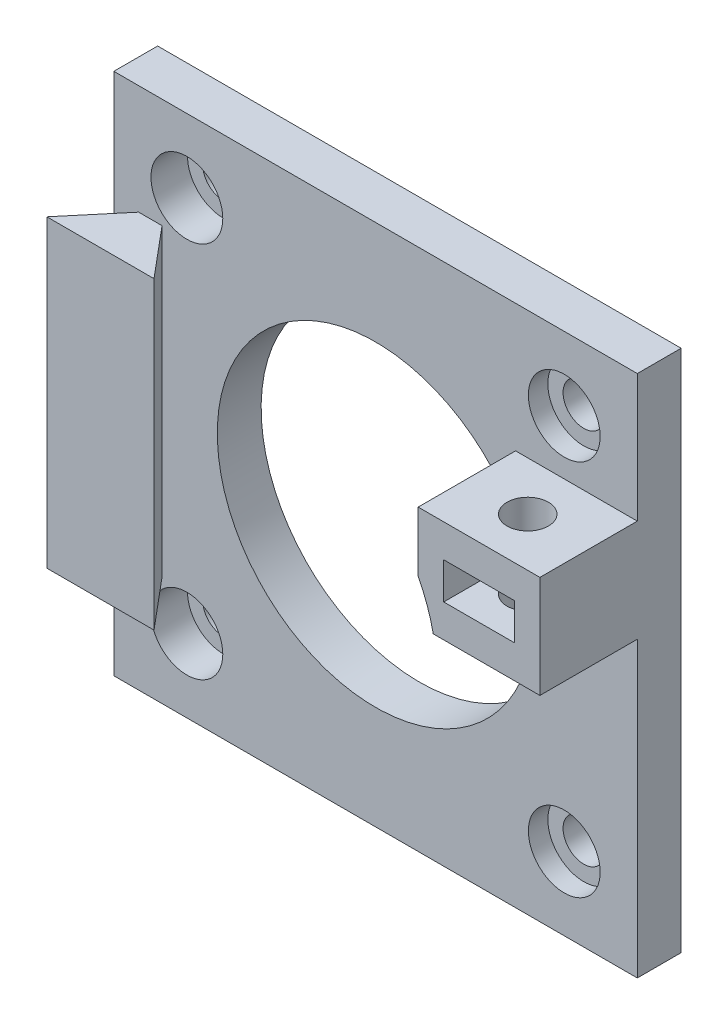
ISO-10303-21;
HEADER;
FILE_DESCRIPTION(('STEP AP214'),'2;1');
FILE_NAME('part.step','',(''),(''),'','','');
FILE_SCHEMA(('AUTOMOTIVE_DESIGN { 1 0 10303 214 1 1 1 1 }'));
ENDSEC;
DATA;
#1=APPLICATION_CONTEXT('core data for automotive mechanical design processes');
#2=APPLICATION_PROTOCOL_DEFINITION('international standard','automotive_design',2000,#1);
#3=PRODUCT_CONTEXT('',#1,'mechanical');
#4=PRODUCT('Part','Part','',(#3));
#5=PRODUCT_RELATED_PRODUCT_CATEGORY('part','',(#4));
#6=PRODUCT_DEFINITION_FORMATION('','',#4);
#7=PRODUCT_DEFINITION_CONTEXT('part definition',#1,'design');
#8=PRODUCT_DEFINITION('design','',#6,#7);
#9=PRODUCT_DEFINITION_SHAPE('','',#8);
#10=(LENGTH_UNIT() NAMED_UNIT(*) SI_UNIT(.MILLI.,.METRE.));
#11=(NAMED_UNIT(*) PLANE_ANGLE_UNIT() SI_UNIT($,.RADIAN.));
#12=(NAMED_UNIT(*) SI_UNIT($,.STERADIAN.) SOLID_ANGLE_UNIT());
#13=UNCERTAINTY_MEASURE_WITH_UNIT(LENGTH_MEASURE(1.E-05),#10,'distance_accuracy_value','');
#14=(GEOMETRIC_REPRESENTATION_CONTEXT(3) GLOBAL_UNCERTAINTY_ASSIGNED_CONTEXT((#13)) GLOBAL_UNIT_ASSIGNED_CONTEXT((#10,
#11,#12)) REPRESENTATION_CONTEXT('',''));
#15=CARTESIAN_POINT('',(0.,0.,0.));
#16=DIRECTION('',(0.,0.,1.));
#17=DIRECTION('',(1.,0.,0.));
#18=AXIS2_PLACEMENT_3D('',#15,#16,#17);
#19=CARTESIAN_POINT('',(-15.5,15.5,3.6));
#20=DIRECTION('',(0.,0.,-1.));
#21=DIRECTION('',(-1.,0.,0.));
#22=AXIS2_PLACEMENT_3D('',#19,#20,#21);
#23=CYLINDRICAL_SURFACE('',#22,1.7);
#24=CARTESIAN_POINT('',(-15.5,15.5,0.));
#25=DIRECTION('',(0.,0.,1.));
#26=DIRECTION('',(1.,0.,0.));
#27=AXIS2_PLACEMENT_3D('',#24,#25,#26);
#28=CIRCLE('',#27,1.7);
#29=CARTESIAN_POINT('',(-13.8,15.5,0.));
#30=VERTEX_POINT('',#29);
#31=EDGE_CURVE('E346',#30,#30,#28,.T.);
#32=ORIENTED_EDGE('',*,*,#31,.F.);
#33=EDGE_LOOP('',(#32));
#34=FACE_BOUND('',#33,.T.);
#35=CARTESIAN_POINT('',(-15.5,15.5,0.6));
#36=DIRECTION('',(0.,0.,1.));
#37=DIRECTION('',(1.,0.,0.));
#38=AXIS2_PLACEMENT_3D('',#35,#36,#37);
#39=CIRCLE('',#38,1.7);
#40=CARTESIAN_POINT('',(-13.8,15.5,0.6));
#41=VERTEX_POINT('',#40);
#42=EDGE_CURVE('E43',#41,#41,#39,.T.);
#43=ORIENTED_EDGE('',*,*,#42,.T.);
#44=EDGE_LOOP('',(#43));
#45=FACE_BOUND('',#44,.T.);
#46=ADVANCED_FACE('F39',(#34,#45),#23,.F.);
#47=CARTESIAN_POINT('',(-15.5,-15.5,3.6));
#48=DIRECTION('',(0.,0.,-1.));
#49=DIRECTION('',(-1.,0.,0.));
#50=AXIS2_PLACEMENT_3D('',#47,#48,#49);
#51=CYLINDRICAL_SURFACE('',#50,1.7);
#52=CARTESIAN_POINT('',(-15.5,-15.5,0.));
#53=DIRECTION('',(0.,0.,1.));
#54=DIRECTION('',(1.,0.,0.));
#55=AXIS2_PLACEMENT_3D('',#52,#53,#54);
#56=CIRCLE('',#55,1.7);
#57=CARTESIAN_POINT('',(-13.8,-15.5,0.));
#58=VERTEX_POINT('',#57);
#59=EDGE_CURVE('E342',#58,#58,#56,.T.);
#60=ORIENTED_EDGE('',*,*,#59,.F.);
#61=EDGE_LOOP('',(#60));
#62=FACE_BOUND('',#61,.T.);
#63=CARTESIAN_POINT('',(-15.5,-15.5,0.6));
#64=DIRECTION('',(0.,0.,1.));
#65=DIRECTION('',(1.,0.,0.));
#66=AXIS2_PLACEMENT_3D('',#63,#64,#65);
#67=CIRCLE('',#66,1.7);
#68=CARTESIAN_POINT('',(-13.8,-15.5,0.6));
#69=VERTEX_POINT('',#68);
#70=EDGE_CURVE('E195',#69,#69,#67,.T.);
#71=ORIENTED_EDGE('',*,*,#70,.T.);
#72=EDGE_LOOP('',(#71));
#73=FACE_BOUND('',#72,.T.);
#74=ADVANCED_FACE('F463',(#62,#73),#51,.F.);
#75=CARTESIAN_POINT('',(16.5,12.6,7.6));
#76=DIRECTION('',(0.,-1.,0.));
#77=DIRECTION('',(1.,0.,0.));
#78=AXIS2_PLACEMENT_3D('',#75,#76,#77);
#79=CYLINDRICAL_SURFACE('',#78,1.7);
#80=CARTESIAN_POINT('',(16.5,11.,7.6));
#81=DIRECTION('',(0.,-1.,0.));
#82=DIRECTION('',(1.,0.,0.));
#83=AXIS2_PLACEMENT_3D('',#80,#81,#82);
#84=CIRCLE('',#83,1.7);
#85=CARTESIAN_POINT('',(18.2,11.,7.6));
#86=VERTEX_POINT('',#85);
#87=EDGE_CURVE('E259',#86,#86,#84,.T.);
#88=ORIENTED_EDGE('',*,*,#87,.F.);
#89=EDGE_LOOP('',(#88));
#90=FACE_BOUND('',#89,.T.);
#91=CARTESIAN_POINT('',(16.5,8.29999999999988,7.6));
#92=DIRECTION('',(0.,-1.,0.));
#93=DIRECTION('',(1.,0.,0.));
#94=AXIS2_PLACEMENT_3D('',#91,#92,#93);
#95=CIRCLE('',#94,1.7);
#96=CARTESIAN_POINT('',(18.2,8.29999999999987,7.6));
#97=VERTEX_POINT('',#96);
#98=EDGE_CURVE('E246',#97,#97,#95,.F.);
#99=ORIENTED_EDGE('',*,*,#98,.F.);
#100=EDGE_LOOP('',(#99));
#101=FACE_BOUND('',#100,.T.);
#102=ADVANCED_FACE('F469',(#90,#101),#79,.F.);
#103=CARTESIAN_POINT('',(15.5,-15.5,3.6));
#104=DIRECTION('',(0.,0.,-1.));
#105=DIRECTION('',(-1.,0.,0.));
#106=AXIS2_PLACEMENT_3D('',#103,#104,#105);
#107=CYLINDRICAL_SURFACE('',#106,1.7);
#108=CARTESIAN_POINT('',(15.5,-15.5,0.));
#109=DIRECTION('',(0.,0.,1.));
#110=DIRECTION('',(1.,0.,0.));
#111=AXIS2_PLACEMENT_3D('',#108,#109,#110);
#112=CIRCLE('',#111,1.7);
#113=CARTESIAN_POINT('',(17.2,-15.5,0.));
#114=VERTEX_POINT('',#113);
#115=EDGE_CURVE('E337',#114,#114,#112,.T.);
#116=ORIENTED_EDGE('',*,*,#115,.F.);
#117=EDGE_LOOP('',(#116));
#118=FACE_BOUND('',#117,.T.);
#119=CARTESIAN_POINT('',(15.5,-15.5,2.));
#120=DIRECTION('',(0.,0.,1.));
#121=DIRECTION('',(1.,0.,0.));
#122=AXIS2_PLACEMENT_3D('',#119,#120,#121);
#123=CIRCLE('',#122,1.7);
#124=CARTESIAN_POINT('',(17.2,-15.5,2.));
#125=VERTEX_POINT('',#124);
#126=EDGE_CURVE('E338',#125,#125,#123,.T.);
#127=ORIENTED_EDGE('',*,*,#126,.T.);
#128=EDGE_LOOP('',(#127));
#129=FACE_BOUND('',#128,.T.);
#130=ADVANCED_FACE('F545',(#118,#129),#107,.F.);
#131=CARTESIAN_POINT('',(15.5,15.5,3.6));
#132=DIRECTION('',(0.,0.,-1.));
#133=DIRECTION('',(-1.,0.,0.));
#134=AXIS2_PLACEMENT_3D('',#131,#132,#133);
#135=CYLINDRICAL_SURFACE('',#134,1.7);
#136=CARTESIAN_POINT('',(15.5,15.5,0.));
#137=DIRECTION('',(0.,0.,1.));
#138=DIRECTION('',(1.,0.,0.));
#139=AXIS2_PLACEMENT_3D('',#136,#137,#138);
#140=CIRCLE('',#139,1.7);
#141=CARTESIAN_POINT('',(17.2,15.5,0.));
#142=VERTEX_POINT('',#141);
#143=EDGE_CURVE('E333',#142,#142,#140,.T.);
#144=ORIENTED_EDGE('',*,*,#143,.F.);
#145=EDGE_LOOP('',(#144));
#146=FACE_BOUND('',#145,.T.);
#147=CARTESIAN_POINT('',(15.5,15.5,2.));
#148=DIRECTION('',(0.,0.,1.));
#149=DIRECTION('',(1.,0.,0.));
#150=AXIS2_PLACEMENT_3D('',#147,#148,#149);
#151=CIRCLE('',#150,1.7);
#152=CARTESIAN_POINT('',(17.2,15.5,2.));
#153=VERTEX_POINT('',#152);
#154=EDGE_CURVE('E332',#153,#153,#151,.T.);
#155=ORIENTED_EDGE('',*,*,#154,.T.);
#156=EDGE_LOOP('',(#155));
#157=FACE_BOUND('',#156,.T.);
#158=ADVANCED_FACE('F486',(#146,#157),#135,.F.);
#159=CARTESIAN_POINT('',(0.,0.,3.6));
#160=DIRECTION('',(0.,0.,1.));
#161=DIRECTION('',(1.,0.,0.));
#162=AXIS2_PLACEMENT_3D('',#159,#160,#161);
#163=PLANE('',#162);
#164=DIRECTION('',(1.,0.,0.));
#165=VECTOR('',#164,1.);
#166=CARTESIAN_POINT('',(0.,-12.5,3.6));
#167=LINE('',#166,#165);
#168=CARTESIAN_POINT('',(-19.4596915121731,-12.5,3.6));
#169=VERTEX_POINT('',#168);
#170=CARTESIAN_POINT('',(-17.5403084878269,-12.5,3.6));
#171=VERTEX_POINT('',#170);
#172=EDGE_CURVE('E11',#169,#171,#167,.T.);
#173=ORIENTED_EDGE('',*,*,#172,.F.);
#174=DIRECTION('',(0.,-1.,0.));
#175=VECTOR('',#174,1.);
#176=CARTESIAN_POINT('',(-19.4596915121731,0.,3.6));
#177=LINE('',#176,#175);
#178=CARTESIAN_POINT('',(-19.4596915121731,12.5,3.6));
#179=VERTEX_POINT('',#178);
#180=EDGE_CURVE('E49',#179,#169,#177,.T.);
#181=ORIENTED_EDGE('',*,*,#180,.F.);
#182=DIRECTION('',(1.,0.,0.));
#183=VECTOR('',#182,1.);
#184=CARTESIAN_POINT('',(0.,12.5,3.6));
#185=LINE('',#184,#183);
#186=CARTESIAN_POINT('',(-17.5403084878269,12.5,3.6));
#187=VERTEX_POINT('',#186);
#188=EDGE_CURVE('E424',#179,#187,#185,.T.);
#189=ORIENTED_EDGE('',*,*,#188,.T.);
#190=DIRECTION('',(0.,1.,0.));
#191=VECTOR('',#190,1.);
#192=CARTESIAN_POINT('',(-17.5403084878269,0.,3.6));
#193=LINE('',#192,#191);
#194=EDGE_CURVE('E183',#171,#187,#193,.T.);
#195=ORIENTED_EDGE('',*,*,#194,.F.);
#196=EDGE_LOOP('',(#173,#181,#189,#195));
#197=FACE_BOUND('',#196,.T.);
#198=DIRECTION('',(0.,-1.,0.));
#199=VECTOR('',#198,1.);
#200=CARTESIAN_POINT('',(11.5,6.06217782649108,3.6));
#201=LINE('',#200,#199);
#202=CARTESIAN_POINT('',(11.5,11.,3.6));
#203=VERTEX_POINT('',#202);
#204=CARTESIAN_POINT('',(11.5,6.06217782649109,3.6));
#205=VERTEX_POINT('',#204);
#206=EDGE_CURVE('E278',#203,#205,#201,.T.);
#207=ORIENTED_EDGE('',*,*,#206,.F.);
#208=DIRECTION('',(-1.,0.,0.));
#209=VECTOR('',#208,1.);
#210=CARTESIAN_POINT('',(21.5,11.,3.6));
#211=LINE('',#210,#209);
#212=CARTESIAN_POINT('',(21.5,11.,3.6));
#213=VERTEX_POINT('',#212);
#214=EDGE_CURVE('E265',#213,#203,#211,.T.);
#215=ORIENTED_EDGE('',*,*,#214,.F.);
#216=DIRECTION('',(0.,1.,0.));
#217=VECTOR('',#216,1.);
#218=CARTESIAN_POINT('',(21.5,-21.5,3.6));
#219=LINE('',#218,#217);
#220=CARTESIAN_POINT('',(21.5,21.5,3.6));
#221=VERTEX_POINT('',#220);
#222=EDGE_CURVE('E367',#213,#221,#219,.T.);
#223=ORIENTED_EDGE('',*,*,#222,.T.);
#224=DIRECTION('',(-1.,0.,0.));
#225=VECTOR('',#224,1.);
#226=CARTESIAN_POINT('',(21.5,21.5,3.6));
#227=LINE('',#226,#225);
#228=CARTESIAN_POINT('',(-21.5,21.5,3.6));
#229=VERTEX_POINT('',#228);
#230=EDGE_CURVE('E371',#221,#229,#227,.T.);
#231=ORIENTED_EDGE('',*,*,#230,.T.);
#232=DIRECTION('',(0.,-1.,0.));
#233=VECTOR('',#232,1.);
#234=CARTESIAN_POINT('',(-21.5,-21.5,3.6));
#235=LINE('',#234,#233);
#236=CARTESIAN_POINT('',(-21.5,-21.5,3.6));
#237=VERTEX_POINT('',#236);
#238=EDGE_CURVE('E359',#229,#237,#235,.T.);
#239=ORIENTED_EDGE('',*,*,#238,.T.);
#240=DIRECTION('',(1.,0.,0.));
#241=VECTOR('',#240,1.);
#242=CARTESIAN_POINT('',(21.5,-21.5,3.6));
#243=LINE('',#242,#241);
#244=CARTESIAN_POINT('',(21.5,-21.5,3.6));
#245=VERTEX_POINT('',#244);
#246=EDGE_CURVE('E363',#237,#245,#243,.T.);
#247=ORIENTED_EDGE('',*,*,#246,.T.);
#248=CARTESIAN_POINT('',(21.5,2.6,3.6));
#249=VERTEX_POINT('',#248);
#250=EDGE_CURVE('E368',#245,#249,#219,.T.);
#251=ORIENTED_EDGE('',*,*,#250,.T.);
#252=DIRECTION('',(1.,0.,0.));
#253=VECTOR('',#252,1.);
#254=CARTESIAN_POINT('',(21.5,2.6,3.6));
#255=LINE('',#254,#253);
#256=CARTESIAN_POINT('',(12.7373466624725,2.6,3.6));
#257=VERTEX_POINT('',#256);
#258=EDGE_CURVE('E282',#257,#249,#255,.T.);
#259=ORIENTED_EDGE('',*,*,#258,.F.);
#260=CARTESIAN_POINT('',(0.,0.,3.6));
#261=DIRECTION('',(0.,0.,1.));
#262=DIRECTION('',(1.,0.,0.));
#263=AXIS2_PLACEMENT_3D('',#260,#261,#262);
#264=CIRCLE('',#263,13.);
#265=EDGE_CURVE('E351',#205,#257,#264,.T.);
#266=ORIENTED_EDGE('',*,*,#265,.F.);
#267=EDGE_LOOP('',(#207,#215,#223,#231,#239,#247,#251,#259,#266));
#268=FACE_BOUND('',#267,.T.);
#269=CARTESIAN_POINT('',(15.5,15.5,3.6));
#270=DIRECTION('',(0.,0.,1.));
#271=DIRECTION('',(1.,0.,0.));
#272=AXIS2_PLACEMENT_3D('',#269,#270,#271);
#273=CIRCLE('',#272,2.95);
#274=CARTESIAN_POINT('',(18.45,15.5,3.6));
#275=VERTEX_POINT('',#274);
#276=EDGE_CURVE('E322',#275,#275,#273,.T.);
#277=ORIENTED_EDGE('',*,*,#276,.F.);
#278=EDGE_LOOP('',(#277));
#279=FACE_BOUND('',#278,.T.);
#280=CARTESIAN_POINT('',(-15.5,-15.5,3.6));
#281=DIRECTION('',(0.,0.,1.));
#282=DIRECTION('',(1.,0.,0.));
#283=AXIS2_PLACEMENT_3D('',#280,#281,#282);
#284=CIRCLE('',#283,2.95);
#285=CARTESIAN_POINT('',(-12.55,-15.5,3.6));
#286=VERTEX_POINT('',#285);
#287=EDGE_CURVE('E313',#286,#286,#284,.T.);
#288=ORIENTED_EDGE('',*,*,#287,.F.);
#289=EDGE_LOOP('',(#288));
#290=FACE_BOUND('',#289,.T.);
#291=CARTESIAN_POINT('',(15.5,-15.5,3.6));
#292=DIRECTION('',(0.,0.,1.));
#293=DIRECTION('',(1.,0.,0.));
#294=AXIS2_PLACEMENT_3D('',#291,#292,#293);
#295=CIRCLE('',#294,2.95);
#296=CARTESIAN_POINT('',(18.45,-15.5,3.6));
#297=VERTEX_POINT('',#296);
#298=EDGE_CURVE('E308',#297,#297,#295,.T.);
#299=ORIENTED_EDGE('',*,*,#298,.F.);
#300=EDGE_LOOP('',(#299));
#301=FACE_BOUND('',#300,.T.);
#302=CARTESIAN_POINT('',(-15.5,15.5,3.6));
#303=DIRECTION('',(0.,0.,1.));
#304=DIRECTION('',(1.,0.,0.));
#305=AXIS2_PLACEMENT_3D('',#302,#303,#304);
#306=CIRCLE('',#305,2.95);
#307=CARTESIAN_POINT('',(-12.55,15.5,3.6));
#308=VERTEX_POINT('',#307);
#309=EDGE_CURVE('E321',#308,#308,#306,.T.);
#310=ORIENTED_EDGE('',*,*,#309,.F.);
#311=EDGE_LOOP('',(#310));
#312=FACE_BOUND('',#311,.T.);
#313=ADVANCED_FACE('F482',(#197,#268,#279,#290,#301,#312),#163,.T.);
#314=CARTESIAN_POINT('',(0.,0.,0.));
#315=DIRECTION('',(0.,0.,1.));
#316=DIRECTION('',(1.,0.,0.));
#317=AXIS2_PLACEMENT_3D('',#314,#315,#316);
#318=PLANE('',#317);
#319=DIRECTION('',(0.,-1.,0.));
#320=VECTOR('',#319,1.);
#321=CARTESIAN_POINT('',(-21.5,-21.5,0.));
#322=LINE('',#321,#320);
#323=CARTESIAN_POINT('',(-21.5,21.5,0.));
#324=VERTEX_POINT('',#323);
#325=CARTESIAN_POINT('',(-21.5,-21.5,0.));
#326=VERTEX_POINT('',#325);
#327=EDGE_CURVE('E355',#324,#326,#322,.T.);
#328=ORIENTED_EDGE('',*,*,#327,.F.);
#329=DIRECTION('',(-1.,0.,0.));
#330=VECTOR('',#329,1.);
#331=CARTESIAN_POINT('',(21.5,21.5,0.));
#332=LINE('',#331,#330);
#333=CARTESIAN_POINT('',(21.5,21.5,0.));
#334=VERTEX_POINT('',#333);
#335=EDGE_CURVE('E364',#334,#324,#332,.T.);
#336=ORIENTED_EDGE('',*,*,#335,.F.);
#337=DIRECTION('',(0.,1.,0.));
#338=VECTOR('',#337,1.);
#339=CARTESIAN_POINT('',(21.5,-21.5,0.));
#340=LINE('',#339,#338);
#341=CARTESIAN_POINT('',(21.5,-21.5,0.));
#342=VERTEX_POINT('',#341);
#343=EDGE_CURVE('E381',#342,#334,#340,.T.);
#344=ORIENTED_EDGE('',*,*,#343,.F.);
#345=DIRECTION('',(1.,0.,0.));
#346=VECTOR('',#345,1.);
#347=CARTESIAN_POINT('',(21.5,-21.5,0.));
#348=LINE('',#347,#346);
#349=EDGE_CURVE('E378',#326,#342,#348,.T.);
#350=ORIENTED_EDGE('',*,*,#349,.F.);
#351=EDGE_LOOP('',(#328,#336,#344,#350));
#352=FACE_BOUND('',#351,.T.);
#353=CARTESIAN_POINT('',(0.,0.,0.));
#354=DIRECTION('',(0.,0.,1.));
#355=DIRECTION('',(1.,0.,0.));
#356=AXIS2_PLACEMENT_3D('',#353,#354,#355);
#357=CIRCLE('',#356,13.);
#358=CARTESIAN_POINT('',(13.,0.,0.));
#359=VERTEX_POINT('',#358);
#360=EDGE_CURVE('E350',#359,#359,#357,.T.);
#361=ORIENTED_EDGE('',*,*,#360,.T.);
#362=EDGE_LOOP('',(#361));
#363=FACE_BOUND('',#362,.T.);
#364=ORIENTED_EDGE('',*,*,#31,.T.);
#365=EDGE_LOOP('',(#364));
#366=FACE_BOUND('',#365,.T.);
#367=ORIENTED_EDGE('',*,*,#59,.T.);
#368=EDGE_LOOP('',(#367));
#369=FACE_BOUND('',#368,.T.);
#370=ORIENTED_EDGE('',*,*,#115,.T.);
#371=EDGE_LOOP('',(#370));
#372=FACE_BOUND('',#371,.T.);
#373=ORIENTED_EDGE('',*,*,#143,.T.);
#374=EDGE_LOOP('',(#373));
#375=FACE_BOUND('',#374,.T.);
#376=ADVANCED_FACE('F485',(#352,#363,#366,#369,#372,#375),#318,.F.);
#377=CARTESIAN_POINT('',(-21.5,-21.5,3.6));
#378=DIRECTION('',(1.,0.,0.));
#379=DIRECTION('',(0.,0.,-1.));
#380=AXIS2_PLACEMENT_3D('',#377,#378,#379);
#381=PLANE('',#380);
#382=ORIENTED_EDGE('',*,*,#327,.T.);
#383=DIRECTION('',(0.,0.,-1.));
#384=VECTOR('',#383,1.);
#385=CARTESIAN_POINT('',(-21.5,-21.5,3.6));
#386=LINE('',#385,#384);
#387=EDGE_CURVE('E397',#237,#326,#386,.T.);
#388=ORIENTED_EDGE('',*,*,#387,.F.);
#389=ORIENTED_EDGE('',*,*,#238,.F.);
#390=DIRECTION('',(0.,0.,-1.));
#391=VECTOR('',#390,1.);
#392=CARTESIAN_POINT('',(-21.5,21.5,3.6));
#393=LINE('',#392,#391);
#394=EDGE_CURVE('E374',#229,#324,#393,.T.);
#395=ORIENTED_EDGE('',*,*,#394,.T.);
#396=EDGE_LOOP('',(#382,#388,#389,#395));
#397=FACE_BOUND('',#396,.T.);
#398=ADVANCED_FACE('F41',(#397),#381,.F.);
#399=CARTESIAN_POINT('',(21.5,-21.5,3.6));
#400=DIRECTION('',(0.,1.,0.));
#401=DIRECTION('',(-1.,0.,0.));
#402=AXIS2_PLACEMENT_3D('',#399,#400,#401);
#403=PLANE('',#402);
#404=ORIENTED_EDGE('',*,*,#349,.T.);
#405=DIRECTION('',(0.,0.,-1.));
#406=VECTOR('',#405,1.);
#407=CARTESIAN_POINT('',(21.5,-21.5,3.6));
#408=LINE('',#407,#406);
#409=EDGE_CURVE('E393',#245,#342,#408,.T.);
#410=ORIENTED_EDGE('',*,*,#409,.F.);
#411=ORIENTED_EDGE('',*,*,#246,.F.);
#412=ORIENTED_EDGE('',*,*,#387,.T.);
#413=EDGE_LOOP('',(#404,#410,#411,#412));
#414=FACE_BOUND('',#413,.T.);
#415=ADVANCED_FACE('F496',(#414),#403,.F.);
#416=CARTESIAN_POINT('',(21.5,-21.5,3.6));
#417=DIRECTION('',(-1.,0.,0.));
#418=DIRECTION('',(0.,0.,1.));
#419=AXIS2_PLACEMENT_3D('',#416,#417,#418);
#420=PLANE('',#419);
#421=ORIENTED_EDGE('',*,*,#343,.T.);
#422=DIRECTION('',(0.,0.,-1.));
#423=VECTOR('',#422,1.);
#424=CARTESIAN_POINT('',(21.5,21.5,3.6));
#425=LINE('',#424,#423);
#426=EDGE_CURVE('E389',#221,#334,#425,.T.);
#427=ORIENTED_EDGE('',*,*,#426,.F.);
#428=ORIENTED_EDGE('',*,*,#222,.F.);
#429=DIRECTION('',(0.,0.,-1.));
#430=VECTOR('',#429,1.);
#431=CARTESIAN_POINT('',(21.5,11.,11.6));
#432=LINE('',#431,#430);
#433=CARTESIAN_POINT('',(21.5,11.,11.6));
#434=VERTEX_POINT('',#433);
#435=EDGE_CURVE('E292',#434,#213,#432,.T.);
#436=ORIENTED_EDGE('',*,*,#435,.F.);
#437=DIRECTION('',(0.,1.,0.));
#438=VECTOR('',#437,1.);
#439=CARTESIAN_POINT('',(21.5,2.6,11.6));
#440=LINE('',#439,#438);
#441=CARTESIAN_POINT('',(21.5,2.6,11.6));
#442=VERTEX_POINT('',#441);
#443=EDGE_CURVE('E271',#442,#434,#440,.T.);
#444=ORIENTED_EDGE('',*,*,#443,.F.);
#445=DIRECTION('',(0.,0.,-1.));
#446=VECTOR('',#445,1.);
#447=CARTESIAN_POINT('',(21.5,2.6,11.6));
#448=LINE('',#447,#446);
#449=EDGE_CURVE('E296',#442,#249,#448,.T.);
#450=ORIENTED_EDGE('',*,*,#449,.T.);
#451=ORIENTED_EDGE('',*,*,#250,.F.);
#452=ORIENTED_EDGE('',*,*,#409,.T.);
#453=EDGE_LOOP('',(#421,#427,#428,#436,#444,#450,#451,#452));
#454=FACE_BOUND('',#453,.T.);
#455=ADVANCED_FACE('F493',(#454),#420,.F.);
#456=CARTESIAN_POINT('',(21.5,21.5,3.6));
#457=DIRECTION('',(0.,-1.,0.));
#458=DIRECTION('',(1.,0.,0.));
#459=AXIS2_PLACEMENT_3D('',#456,#457,#458);
#460=PLANE('',#459);
#461=ORIENTED_EDGE('',*,*,#335,.T.);
#462=ORIENTED_EDGE('',*,*,#394,.F.);
#463=ORIENTED_EDGE('',*,*,#230,.F.);
#464=ORIENTED_EDGE('',*,*,#426,.T.);
#465=EDGE_LOOP('',(#461,#462,#463,#464));
#466=FACE_BOUND('',#465,.T.);
#467=ADVANCED_FACE('F480',(#466),#460,.F.);
#468=CARTESIAN_POINT('',(0.,0.,3.6));
#469=DIRECTION('',(0.,0.,-1.));
#470=DIRECTION('',(-1.,0.,0.));
#471=AXIS2_PLACEMENT_3D('',#468,#469,#470);
#472=CYLINDRICAL_SURFACE('',#471,13.);
#473=ORIENTED_EDGE('',*,*,#265,.T.);
#474=DIRECTION('',(0.,0.,-1.));
#475=VECTOR('',#474,1.);
#476=CARTESIAN_POINT('',(12.7373466624725,2.6,11.6));
#477=LINE('',#476,#475);
#478=CARTESIAN_POINT('',(12.7373466624725,2.6,11.6));
#479=VERTEX_POINT('',#478);
#480=EDGE_CURVE('E300',#479,#257,#477,.T.);
#481=ORIENTED_EDGE('',*,*,#480,.F.);
#482=CARTESIAN_POINT('',(0.,0.,11.6));
#483=DIRECTION('',(0.,0.,-1.));
#484=DIRECTION('',(1.,0.,0.));
#485=AXIS2_PLACEMENT_3D('',#482,#483,#484);
#486=CIRCLE('',#485,13.);
#487=CARTESIAN_POINT('',(11.5,6.06217782649108,11.6));
#488=VERTEX_POINT('',#487);
#489=EDGE_CURVE('E264',#488,#479,#486,.T.);
#490=ORIENTED_EDGE('',*,*,#489,.F.);
#491=DIRECTION('',(0.,0.,-1.));
#492=VECTOR('',#491,1.);
#493=CARTESIAN_POINT('',(11.5,6.06217782649108,11.6));
#494=LINE('',#493,#492);
#495=EDGE_CURVE('E304',#488,#205,#494,.T.);
#496=ORIENTED_EDGE('',*,*,#495,.T.);
#497=EDGE_LOOP('',(#473,#481,#490,#496));
#498=FACE_BOUND('',#497,.T.);
#499=ORIENTED_EDGE('',*,*,#360,.F.);
#500=EDGE_LOOP('',(#499));
#501=FACE_BOUND('',#500,.T.);
#502=ADVANCED_FACE('F476',(#498,#501),#472,.F.);
#503=CARTESIAN_POINT('',(15.5,15.5,2.));
#504=DIRECTION('',(0.,0.,1.));
#505=DIRECTION('',(1.,0.,0.));
#506=AXIS2_PLACEMENT_3D('',#503,#504,#505);
#507=CYLINDRICAL_SURFACE('',#506,2.95);
#508=CARTESIAN_POINT('',(15.5,15.5,2.));
#509=DIRECTION('',(0.,0.,1.));
#510=DIRECTION('',(1.,0.,0.));
#511=AXIS2_PLACEMENT_3D('',#508,#509,#510);
#512=CIRCLE('',#511,2.95);
#513=CARTESIAN_POINT('',(18.45,15.5,2.));
#514=VERTEX_POINT('',#513);
#515=EDGE_CURVE('E317',#514,#514,#512,.T.);
#516=ORIENTED_EDGE('',*,*,#515,.F.);
#517=EDGE_LOOP('',(#516));
#518=FACE_BOUND('',#517,.T.);
#519=ORIENTED_EDGE('',*,*,#276,.T.);
#520=EDGE_LOOP('',(#519));
#521=FACE_BOUND('',#520,.T.);
#522=ADVANCED_FACE('F479',(#518,#521),#507,.F.);
#523=CARTESIAN_POINT('',(15.5,15.5,2.));
#524=DIRECTION('',(0.,0.,1.));
#525=DIRECTION('',(1.,0.,0.));
#526=AXIS2_PLACEMENT_3D('',#523,#524,#525);
#527=PLANE('',#526);
#528=ORIENTED_EDGE('',*,*,#154,.F.);
#529=EDGE_LOOP('',(#528));
#530=FACE_BOUND('',#529,.T.);
#531=ORIENTED_EDGE('',*,*,#515,.T.);
#532=EDGE_LOOP('',(#531));
#533=FACE_BOUND('',#532,.T.);
#534=ADVANCED_FACE('F548',(#530,#533),#527,.T.);
#535=CARTESIAN_POINT('',(15.5,-15.5,2.));
#536=DIRECTION('',(0.,0.,1.));
#537=DIRECTION('',(1.,0.,0.));
#538=AXIS2_PLACEMENT_3D('',#535,#536,#537);
#539=CYLINDRICAL_SURFACE('',#538,2.95);
#540=CARTESIAN_POINT('',(15.5,-15.5,2.));
#541=DIRECTION('',(0.,0.,1.));
#542=DIRECTION('',(1.,0.,0.));
#543=AXIS2_PLACEMENT_3D('',#540,#541,#542);
#544=CIRCLE('',#543,2.95);
#545=CARTESIAN_POINT('',(18.45,-15.5,2.));
#546=VERTEX_POINT('',#545);
#547=EDGE_CURVE('E309',#546,#546,#544,.T.);
#548=ORIENTED_EDGE('',*,*,#547,.F.);
#549=EDGE_LOOP('',(#548));
#550=FACE_BOUND('',#549,.T.);
#551=ORIENTED_EDGE('',*,*,#298,.T.);
#552=EDGE_LOOP('',(#551));
#553=FACE_BOUND('',#552,.T.);
#554=ADVANCED_FACE('F551',(#550,#553),#539,.F.);
#555=CARTESIAN_POINT('',(15.5,-15.5,2.));
#556=DIRECTION('',(0.,0.,1.));
#557=DIRECTION('',(1.,0.,0.));
#558=AXIS2_PLACEMENT_3D('',#555,#556,#557);
#559=PLANE('',#558);
#560=ORIENTED_EDGE('',*,*,#126,.F.);
#561=EDGE_LOOP('',(#560));
#562=FACE_BOUND('',#561,.T.);
#563=ORIENTED_EDGE('',*,*,#547,.T.);
#564=EDGE_LOOP('',(#563));
#565=FACE_BOUND('',#564,.T.);
#566=ADVANCED_FACE('F458',(#562,#565),#559,.T.);
#567=CARTESIAN_POINT('',(-15.5,-15.5,2.));
#568=DIRECTION('',(0.,0.,1.));
#569=DIRECTION('',(1.,0.,0.));
#570=AXIS2_PLACEMENT_3D('',#567,#568,#569);
#571=CYLINDRICAL_SURFACE('',#570,2.95);
#572=ORIENTED_EDGE('',*,*,#287,.T.);
#573=EDGE_LOOP('',(#572));
#574=FACE_BOUND('',#573,.T.);
#575=CARTESIAN_POINT('',(-15.5,-15.5,0.6));
#576=DIRECTION('',(0.,0.,1.));
#577=DIRECTION('',(1.,0.,0.));
#578=AXIS2_PLACEMENT_3D('',#575,#576,#577);
#579=CIRCLE('',#578,2.95);
#580=CARTESIAN_POINT('',(-12.55,-15.5,0.6));
#581=VERTEX_POINT('',#580);
#582=EDGE_CURVE('E432',#581,#581,#579,.T.);
#583=ORIENTED_EDGE('',*,*,#582,.F.);
#584=EDGE_LOOP('',(#583));
#585=FACE_BOUND('',#584,.T.);
#586=ADVANCED_FACE('F448',(#574,#585),#571,.F.);
#587=CARTESIAN_POINT('',(-15.5,15.5,2.));
#588=DIRECTION('',(0.,0.,1.));
#589=DIRECTION('',(1.,0.,0.));
#590=AXIS2_PLACEMENT_3D('',#587,#588,#589);
#591=CYLINDRICAL_SURFACE('',#590,2.95);
#592=ORIENTED_EDGE('',*,*,#309,.T.);
#593=EDGE_LOOP('',(#592));
#594=FACE_BOUND('',#593,.T.);
#595=CARTESIAN_POINT('',(-15.5,15.5,0.6));
#596=DIRECTION('',(0.,0.,1.));
#597=DIRECTION('',(1.,0.,0.));
#598=AXIS2_PLACEMENT_3D('',#595,#596,#597);
#599=CIRCLE('',#598,2.95);
#600=CARTESIAN_POINT('',(-12.55,15.5,0.6));
#601=VERTEX_POINT('',#600);
#602=EDGE_CURVE('E197',#601,#601,#599,.T.);
#603=ORIENTED_EDGE('',*,*,#602,.F.);
#604=EDGE_LOOP('',(#603));
#605=FACE_BOUND('',#604,.T.);
#606=ADVANCED_FACE('F445',(#594,#605),#591,.F.);
#607=CARTESIAN_POINT('',(11.5,6.06217782649108,11.6));
#608=DIRECTION('',(1.,0.,0.));
#609=DIRECTION('',(0.,0.,-1.));
#610=AXIS2_PLACEMENT_3D('',#607,#608,#609);
#611=PLANE('',#610);
#612=ORIENTED_EDGE('',*,*,#206,.T.);
#613=ORIENTED_EDGE('',*,*,#495,.F.);
#614=DIRECTION('',(0.,-1.,0.));
#615=VECTOR('',#614,1.);
#616=CARTESIAN_POINT('',(11.5,6.06217782649108,11.6));
#617=LINE('',#616,#615);
#618=CARTESIAN_POINT('',(11.5,11.,11.6));
#619=VERTEX_POINT('',#618);
#620=EDGE_CURVE('E260',#619,#488,#617,.T.);
#621=ORIENTED_EDGE('',*,*,#620,.F.);
#622=DIRECTION('',(0.,0.,-1.));
#623=VECTOR('',#622,1.);
#624=CARTESIAN_POINT('',(11.5,11.,11.6));
#625=LINE('',#624,#623);
#626=EDGE_CURVE('E277',#619,#203,#625,.T.);
#627=ORIENTED_EDGE('',*,*,#626,.T.);
#628=EDGE_LOOP('',(#612,#613,#621,#627));
#629=FACE_BOUND('',#628,.T.);
#630=ADVANCED_FACE('F447',(#629),#611,.F.);
#631=CARTESIAN_POINT('',(21.5,2.6,11.6));
#632=DIRECTION('',(0.,1.,0.));
#633=DIRECTION('',(-1.,0.,0.));
#634=AXIS2_PLACEMENT_3D('',#631,#632,#633);
#635=PLANE('',#634);
#636=CARTESIAN_POINT('',(16.5,2.6,7.6));
#637=DIRECTION('',(0.,-1.,0.));
#638=DIRECTION('',(1.,0.,0.));
#639=AXIS2_PLACEMENT_3D('',#636,#637,#638);
#640=CIRCLE('',#639,1.7);
#641=CARTESIAN_POINT('',(18.2,2.6,7.6));
#642=VERTEX_POINT('',#641);
#643=EDGE_CURVE('E255',#642,#642,#640,.T.);
#644=ORIENTED_EDGE('',*,*,#643,.F.);
#645=EDGE_LOOP('',(#644));
#646=FACE_BOUND('',#645,.T.);
#647=ORIENTED_EDGE('',*,*,#258,.T.);
#648=ORIENTED_EDGE('',*,*,#449,.F.);
#649=DIRECTION('',(1.,0.,0.));
#650=VECTOR('',#649,1.);
#651=CARTESIAN_POINT('',(21.5,2.6,11.6));
#652=LINE('',#651,#650);
#653=EDGE_CURVE('E268',#479,#442,#652,.T.);
#654=ORIENTED_EDGE('',*,*,#653,.F.);
#655=ORIENTED_EDGE('',*,*,#480,.T.);
#656=EDGE_LOOP('',(#647,#648,#654,#655));
#657=FACE_BOUND('',#656,.T.);
#658=ADVANCED_FACE('F455',(#646,#657),#635,.F.);
#659=CARTESIAN_POINT('',(21.5,11.,11.6));
#660=DIRECTION('',(0.,-1.,0.));
#661=DIRECTION('',(1.,0.,0.));
#662=AXIS2_PLACEMENT_3D('',#659,#660,#661);
#663=PLANE('',#662);
#664=ORIENTED_EDGE('',*,*,#87,.T.);
#665=EDGE_LOOP('',(#664));
#666=FACE_BOUND('',#665,.T.);
#667=ORIENTED_EDGE('',*,*,#214,.T.);
#668=ORIENTED_EDGE('',*,*,#626,.F.);
#669=DIRECTION('',(-1.,0.,0.));
#670=VECTOR('',#669,1.);
#671=CARTESIAN_POINT('',(21.5,11.,11.6));
#672=LINE('',#671,#670);
#673=EDGE_CURVE('E274',#434,#619,#672,.T.);
#674=ORIENTED_EDGE('',*,*,#673,.F.);
#675=ORIENTED_EDGE('',*,*,#435,.T.);
#676=EDGE_LOOP('',(#667,#668,#674,#675));
#677=FACE_BOUND('',#676,.T.);
#678=ADVANCED_FACE('F523',(#666,#677),#663,.F.);
#679=CARTESIAN_POINT('',(0.,0.,11.6));
#680=DIRECTION('',(0.,0.,1.));
#681=DIRECTION('',(1.,0.,0.));
#682=AXIS2_PLACEMENT_3D('',#679,#680,#681);
#683=PLANE('',#682);
#684=DIRECTION('',(1.,0.,0.));
#685=VECTOR('',#684,1.);
#686=CARTESIAN_POINT('',(0.,5.3,11.6));
#687=LINE('',#686,#685);
#688=CARTESIAN_POINT('',(13.5988148973221,5.29999999999991,11.6));
#689=VERTEX_POINT('',#688);
#690=CARTESIAN_POINT('',(19.4011851026779,5.29999999999986,11.6));
#691=VERTEX_POINT('',#690);
#692=EDGE_CURVE('E252',#689,#691,#687,.T.);
#693=ORIENTED_EDGE('',*,*,#692,.F.);
#694=DIRECTION('',(0.,1.,0.));
#695=VECTOR('',#694,1.);
#696=CARTESIAN_POINT('',(13.5988148973221,0.,11.6));
#697=LINE('',#696,#695);
#698=CARTESIAN_POINT('',(13.5988148973222,8.2999999999999,11.6));
#699=VERTEX_POINT('',#698);
#700=EDGE_CURVE('E401',#689,#699,#697,.T.);
#701=ORIENTED_EDGE('',*,*,#700,.T.);
#702=DIRECTION('',(1.,0.,0.));
#703=VECTOR('',#702,1.);
#704=CARTESIAN_POINT('',(0.,8.3,11.6));
#705=LINE('',#704,#703);
#706=CARTESIAN_POINT('',(19.4011851026779,8.29999999999986,11.6));
#707=VERTEX_POINT('',#706);
#708=EDGE_CURVE('E247',#699,#707,#705,.T.);
#709=ORIENTED_EDGE('',*,*,#708,.T.);
#710=DIRECTION('',(0.,-1.,0.));
#711=VECTOR('',#710,1.);
#712=CARTESIAN_POINT('',(19.4011851026778,-1.35477751474882E-13,11.6));
#713=LINE('',#712,#711);
#714=EDGE_CURVE('E420',#707,#691,#713,.T.);
#715=ORIENTED_EDGE('',*,*,#714,.T.);
#716=EDGE_LOOP('',(#693,#701,#709,#715));
#717=FACE_BOUND('',#716,.T.);
#718=ORIENTED_EDGE('',*,*,#620,.T.);
#719=ORIENTED_EDGE('',*,*,#489,.T.);
#720=ORIENTED_EDGE('',*,*,#653,.T.);
#721=ORIENTED_EDGE('',*,*,#443,.T.);
#722=ORIENTED_EDGE('',*,*,#673,.T.);
#723=EDGE_LOOP('',(#718,#719,#720,#721,#722));
#724=FACE_BOUND('',#723,.T.);
#725=ADVANCED_FACE('F527',(#717,#724),#683,.T.);
#726=CARTESIAN_POINT('',(16.5,5.29999999999988,7.6));
#727=DIRECTION('',(0.,-1.,0.));
#728=DIRECTION('',(1.,0.,0.));
#729=AXIS2_PLACEMENT_3D('',#726,#727,#728);
#730=CIRCLE('',#729,1.7);
#731=CARTESIAN_POINT('',(18.2,5.29999999999987,7.6));
#732=VERTEX_POINT('',#731);
#733=EDGE_CURVE('E251',#732,#732,#730,.F.);
#734=ORIENTED_EDGE('',*,*,#733,.T.);
#735=EDGE_LOOP('',(#734));
#736=FACE_BOUND('',#735,.T.);
#737=ORIENTED_EDGE('',*,*,#643,.T.);
#738=EDGE_LOOP('',(#737));
#739=FACE_BOUND('',#738,.T.);
#740=ADVANCED_FACE('F584',(#736,#739),#79,.F.);
#741=CARTESIAN_POINT('',(0.,5.3,0.));
#742=DIRECTION('',(0.,-1.,0.));
#743=DIRECTION('',(1.,0.,0.));
#744=AXIS2_PLACEMENT_3D('',#741,#742,#743);
#745=PLANE('',#744);
#746=ORIENTED_EDGE('',*,*,#692,.T.);
#747=DIRECTION('',(0.,0.,1.));
#748=VECTOR('',#747,1.);
#749=CARTESIAN_POINT('',(19.4011851026779,5.29999999999986,5.925));
#750=LINE('',#749,#748);
#751=CARTESIAN_POINT('',(19.4011851026779,5.29999999999986,5.925));
#752=VERTEX_POINT('',#751);
#753=EDGE_CURVE('E232',#752,#691,#750,.T.);
#754=ORIENTED_EDGE('',*,*,#753,.F.);
#755=DIRECTION('',(0.866025403784439,0.,0.5));
#756=VECTOR('',#755,1.);
#757=CARTESIAN_POINT('',(16.5,5.29999999999988,4.25));
#758=LINE('',#757,#756);
#759=CARTESIAN_POINT('',(16.5,5.29999999999988,4.25));
#760=VERTEX_POINT('',#759);
#761=EDGE_CURVE('E229',#760,#752,#758,.T.);
#762=ORIENTED_EDGE('',*,*,#761,.F.);
#763=DIRECTION('',(0.866025403784439,0.,-0.5));
#764=VECTOR('',#763,1.);
#765=CARTESIAN_POINT('',(13.5988148973221,5.29999999999991,5.925));
#766=LINE('',#765,#764);
#767=CARTESIAN_POINT('',(13.5988148973221,5.29999999999991,5.925));
#768=VERTEX_POINT('',#767);
#769=EDGE_CURVE('E226',#768,#760,#766,.T.);
#770=ORIENTED_EDGE('',*,*,#769,.F.);
#771=DIRECTION('',(0.,0.,-1.));
#772=VECTOR('',#771,1.);
#773=CARTESIAN_POINT('',(13.5988148973221,5.29999999999991,9.275));
#774=LINE('',#773,#772);
#775=EDGE_CURVE('E223',#689,#768,#774,.T.);
#776=ORIENTED_EDGE('',*,*,#775,.F.);
#777=EDGE_LOOP('',(#746,#754,#762,#770,#776));
#778=FACE_BOUND('',#777,.T.);
#779=ORIENTED_EDGE('',*,*,#733,.F.);
#780=EDGE_LOOP('',(#779));
#781=FACE_BOUND('',#780,.T.);
#782=ADVANCED_FACE('F588',(#778,#781),#745,.F.);
#783=CARTESIAN_POINT('',(0.,8.3,0.));
#784=DIRECTION('',(0.,-1.,0.));
#785=DIRECTION('',(1.,0.,0.));
#786=AXIS2_PLACEMENT_3D('',#783,#784,#785);
#787=PLANE('',#786);
#788=DIRECTION('',(0.,0.,-1.));
#789=VECTOR('',#788,1.);
#790=CARTESIAN_POINT('',(13.5988148973222,8.2999999999999,9.275));
#791=LINE('',#790,#789);
#792=CARTESIAN_POINT('',(13.5988148973222,8.2999999999999,5.925));
#793=VERTEX_POINT('',#792);
#794=EDGE_CURVE('E210',#699,#793,#791,.T.);
#795=ORIENTED_EDGE('',*,*,#794,.T.);
#796=DIRECTION('',(0.866025403784439,0.,-0.5));
#797=VECTOR('',#796,1.);
#798=CARTESIAN_POINT('',(13.5988148973222,8.2999999999999,5.925));
#799=LINE('',#798,#797);
#800=CARTESIAN_POINT('',(16.5,8.29999999999988,4.25));
#801=VERTEX_POINT('',#800);
#802=EDGE_CURVE('E214',#793,#801,#799,.T.);
#803=ORIENTED_EDGE('',*,*,#802,.T.);
#804=DIRECTION('',(0.866025403784439,0.,0.5));
#805=VECTOR('',#804,1.);
#806=CARTESIAN_POINT('',(16.5,8.29999999999988,4.25));
#807=LINE('',#806,#805);
#808=CARTESIAN_POINT('',(19.4011851026779,8.29999999999986,5.925));
#809=VERTEX_POINT('',#808);
#810=EDGE_CURVE('E218',#801,#809,#807,.T.);
#811=ORIENTED_EDGE('',*,*,#810,.T.);
#812=DIRECTION('',(0.,0.,1.));
#813=VECTOR('',#812,1.);
#814=CARTESIAN_POINT('',(19.4011851026779,8.29999999999986,5.925));
#815=LINE('',#814,#813);
#816=EDGE_CURVE('E65',#809,#707,#815,.T.);
#817=ORIENTED_EDGE('',*,*,#816,.T.);
#818=ORIENTED_EDGE('',*,*,#708,.F.);
#819=EDGE_LOOP('',(#795,#803,#811,#817,#818));
#820=FACE_BOUND('',#819,.T.);
#821=ORIENTED_EDGE('',*,*,#98,.T.);
#822=EDGE_LOOP('',(#821));
#823=FACE_BOUND('',#822,.T.);
#824=ADVANCED_FACE('F594',(#820,#823),#787,.T.);
#825=CARTESIAN_POINT('',(13.5988148973221,5.29999999999991,5.925));
#826=DIRECTION('',(0.5,0.,0.866025403784439));
#827=DIRECTION('',(0.866025403784439,0.,-0.5));
#828=AXIS2_PLACEMENT_3D('',#825,#826,#827);
#829=PLANE('',#828);
#830=DIRECTION('',(0.,1.,0.));
#831=VECTOR('',#830,1.);
#832=CARTESIAN_POINT('',(13.5988148973221,5.29999999999991,5.925));
#833=LINE('',#832,#831);
#834=EDGE_CURVE('E242',#768,#793,#833,.T.);
#835=ORIENTED_EDGE('',*,*,#834,.F.);
#836=ORIENTED_EDGE('',*,*,#769,.T.);
#837=DIRECTION('',(0.,1.,0.));
#838=VECTOR('',#837,1.);
#839=CARTESIAN_POINT('',(16.5,5.29999999999988,4.25));
#840=LINE('',#839,#838);
#841=EDGE_CURVE('E239',#760,#801,#840,.T.);
#842=ORIENTED_EDGE('',*,*,#841,.T.);
#843=ORIENTED_EDGE('',*,*,#802,.F.);
#844=EDGE_LOOP('',(#835,#836,#842,#843));
#845=FACE_BOUND('',#844,.T.);
#846=ADVANCED_FACE('F590',(#845),#829,.T.);
#847=CARTESIAN_POINT('',(16.5,5.29999999999988,4.25));
#848=DIRECTION('',(-0.5,0.,0.866025403784439));
#849=DIRECTION('',(0.866025403784439,0.,0.5));
#850=AXIS2_PLACEMENT_3D('',#847,#848,#849);
#851=PLANE('',#850);
#852=ORIENTED_EDGE('',*,*,#841,.F.);
#853=ORIENTED_EDGE('',*,*,#761,.T.);
#854=DIRECTION('',(0.,1.,0.));
#855=VECTOR('',#854,1.);
#856=CARTESIAN_POINT('',(19.4011851026779,5.29999999999986,5.925));
#857=LINE('',#856,#855);
#858=EDGE_CURVE('E236',#752,#809,#857,.T.);
#859=ORIENTED_EDGE('',*,*,#858,.T.);
#860=ORIENTED_EDGE('',*,*,#810,.F.);
#861=EDGE_LOOP('',(#852,#853,#859,#860));
#862=FACE_BOUND('',#861,.T.);
#863=ADVANCED_FACE('F593',(#862),#851,.T.);
#864=CARTESIAN_POINT('',(19.4011851026779,5.29999999999986,15.925));
#865=DIRECTION('',(-1.,0.,0.));
#866=DIRECTION('',(0.,-1.,0.));
#867=AXIS2_PLACEMENT_3D('',#864,#865,#866);
#868=PLANE('',#867);
#869=ORIENTED_EDGE('',*,*,#816,.F.);
#870=ORIENTED_EDGE('',*,*,#858,.F.);
#871=ORIENTED_EDGE('',*,*,#753,.T.);
#872=ORIENTED_EDGE('',*,*,#714,.F.);
#873=EDGE_LOOP('',(#869,#870,#871,#872));
#874=FACE_BOUND('',#873,.T.);
#875=ADVANCED_FACE('F598',(#874),#868,.T.);
#876=CARTESIAN_POINT('',(13.5988148973221,5.29999999999991,9.275));
#877=DIRECTION('',(1.,0.,0.));
#878=DIRECTION('',(0.,1.,0.));
#879=AXIS2_PLACEMENT_3D('',#876,#877,#878);
#880=PLANE('',#879);
#881=ORIENTED_EDGE('',*,*,#775,.T.);
#882=ORIENTED_EDGE('',*,*,#834,.T.);
#883=ORIENTED_EDGE('',*,*,#794,.F.);
#884=ORIENTED_EDGE('',*,*,#700,.F.);
#885=EDGE_LOOP('',(#881,#882,#883,#884));
#886=FACE_BOUND('',#885,.T.);
#887=ADVANCED_FACE('F602',(#886),#880,.T.);
#888=CARTESIAN_POINT('',(-14.1,-12.5,7.7));
#889=DIRECTION('',(0.,0.,1.));
#890=DIRECTION('',(1.,0.,0.));
#891=AXIS2_PLACEMENT_3D('',#888,#889,#890);
#892=PLANE('',#891);
#893=DIRECTION('',(0.,1.,0.));
#894=VECTOR('',#893,1.);
#895=CARTESIAN_POINT('',(-14.1,-12.5,7.7));
#896=LINE('',#895,#894);
#897=CARTESIAN_POINT('',(-14.1,-12.5,7.7));
#898=VERTEX_POINT('',#897);
#899=CARTESIAN_POINT('',(-14.1,12.5,7.7));
#900=VERTEX_POINT('',#899);
#901=EDGE_CURVE('E168',#898,#900,#896,.T.);
#902=ORIENTED_EDGE('',*,*,#901,.T.);
#903=DIRECTION('',(1.,0.,0.));
#904=VECTOR('',#903,1.);
#905=CARTESIAN_POINT('',(-14.1,12.5,7.7));
#906=LINE('',#905,#904);
#907=CARTESIAN_POINT('',(-22.9,12.5,7.7));
#908=VERTEX_POINT('',#907);
#909=EDGE_CURVE('E171',#908,#900,#906,.T.);
#910=ORIENTED_EDGE('',*,*,#909,.F.);
#911=DIRECTION('',(0.,1.,0.));
#912=VECTOR('',#911,1.);
#913=CARTESIAN_POINT('',(-22.9,-12.5,7.7));
#914=LINE('',#913,#912);
#915=CARTESIAN_POINT('',(-22.9,-12.5,7.7));
#916=VERTEX_POINT('',#915);
#917=EDGE_CURVE('E178',#916,#908,#914,.T.);
#918=ORIENTED_EDGE('',*,*,#917,.F.);
#919=DIRECTION('',(1.,0.,0.));
#920=VECTOR('',#919,1.);
#921=CARTESIAN_POINT('',(-14.1,-12.5,7.7));
#922=LINE('',#921,#920);
#923=EDGE_CURVE('E173',#916,#898,#922,.T.);
#924=ORIENTED_EDGE('',*,*,#923,.T.);
#925=EDGE_LOOP('',(#902,#910,#918,#924));
#926=FACE_BOUND('',#925,.T.);
#927=ADVANCED_FACE('F169',(#926),#892,.T.);
#928=CARTESIAN_POINT('',(-22.9,-12.5,7.7));
#929=DIRECTION('',(-0.766044443118975,0.,-0.642787609686544));
#930=DIRECTION('',(-0.642787609686544,0.,0.766044443118975));
#931=AXIS2_PLACEMENT_3D('',#928,#929,#930);
#932=PLANE('',#931);
#933=DIRECTION('',(-0.642787609686543,0.,0.766044443118975));
#934=VECTOR('',#933,1.);
#935=CARTESIAN_POINT('',(-22.9,12.5,7.7));
#936=LINE('',#935,#934);
#937=EDGE_CURVE('E186',#179,#908,#936,.T.);
#938=ORIENTED_EDGE('',*,*,#937,.F.);
#939=ORIENTED_EDGE('',*,*,#180,.T.);
#940=DIRECTION('',(-0.642787609686543,0.,0.766044443118975));
#941=VECTOR('',#940,1.);
#942=CARTESIAN_POINT('',(-22.9,-12.5,7.7));
#943=LINE('',#942,#941);
#944=EDGE_CURVE('E179',#169,#916,#943,.T.);
#945=ORIENTED_EDGE('',*,*,#944,.T.);
#946=ORIENTED_EDGE('',*,*,#917,.T.);
#947=EDGE_LOOP('',(#938,#939,#945,#946));
#948=FACE_BOUND('',#947,.T.);
#949=ADVANCED_FACE('F614',(#948),#932,.T.);
#950=CARTESIAN_POINT('',(-18.5,-12.5,2.45628419258553));
#951=DIRECTION('',(0.766044443118974,0.,-0.642787609686544));
#952=DIRECTION('',(-0.642787609686544,0.,-0.766044443118974));
#953=AXIS2_PLACEMENT_3D('',#950,#951,#952);
#954=PLANE('',#953);
#955=DIRECTION('',(-0.642787609686543,0.,-0.766044443118974));
#956=VECTOR('',#955,1.);
#957=CARTESIAN_POINT('',(-18.5,-12.5,2.45628419258553));
#958=LINE('',#957,#956);
#959=EDGE_CURVE('E204',#898,#171,#958,.T.);
#960=ORIENTED_EDGE('',*,*,#959,.T.);
#961=ORIENTED_EDGE('',*,*,#194,.T.);
#962=DIRECTION('',(-0.642787609686543,0.,-0.766044443118974));
#963=VECTOR('',#962,1.);
#964=CARTESIAN_POINT('',(-18.5,12.5,2.45628419258553));
#965=LINE('',#964,#963);
#966=EDGE_CURVE('E57',#900,#187,#965,.T.);
#967=ORIENTED_EDGE('',*,*,#966,.F.);
#968=ORIENTED_EDGE('',*,*,#901,.F.);
#969=EDGE_LOOP('',(#960,#961,#967,#968));
#970=FACE_BOUND('',#969,.T.);
#971=ADVANCED_FACE('F181',(#970),#954,.T.);
#972=CARTESIAN_POINT('',(0.,-12.5,0.));
#973=DIRECTION('',(0.,-1.,0.));
#974=DIRECTION('',(0.,0.,-1.));
#975=AXIS2_PLACEMENT_3D('',#972,#973,#974);
#976=PLANE('',#975);
#977=ORIENTED_EDGE('',*,*,#944,.F.);
#978=ORIENTED_EDGE('',*,*,#172,.T.);
#979=ORIENTED_EDGE('',*,*,#959,.F.);
#980=ORIENTED_EDGE('',*,*,#923,.F.);
#981=EDGE_LOOP('',(#977,#978,#979,#980));
#982=FACE_BOUND('',#981,.T.);
#983=ADVANCED_FACE('F617',(#982),#976,.T.);
#984=CARTESIAN_POINT('',(0.,12.5,0.));
#985=DIRECTION('',(0.,-1.,0.));
#986=DIRECTION('',(0.,0.,-1.));
#987=AXIS2_PLACEMENT_3D('',#984,#985,#986);
#988=PLANE('',#987);
#989=ORIENTED_EDGE('',*,*,#188,.F.);
#990=ORIENTED_EDGE('',*,*,#937,.T.);
#991=ORIENTED_EDGE('',*,*,#909,.T.);
#992=ORIENTED_EDGE('',*,*,#966,.T.);
#993=EDGE_LOOP('',(#989,#990,#991,#992));
#994=FACE_BOUND('',#993,.T.);
#995=ADVANCED_FACE('F188',(#994),#988,.F.);
#996=CARTESIAN_POINT('',(-15.5,15.5,0.6));
#997=DIRECTION('',(0.,0.,1.));
#998=DIRECTION('',(1.,0.,0.));
#999=AXIS2_PLACEMENT_3D('',#996,#997,#998);
#1000=PLANE('',#999);
#1001=ORIENTED_EDGE('',*,*,#42,.F.);
#1002=EDGE_LOOP('',(#1001));
#1003=FACE_BOUND('',#1002,.T.);
#1004=ORIENTED_EDGE('',*,*,#602,.T.);
#1005=EDGE_LOOP('',(#1004));
#1006=FACE_BOUND('',#1005,.T.);
#1007=ADVANCED_FACE('F443',(#1003,#1006),#1000,.T.);
#1008=CARTESIAN_POINT('',(-15.5,-15.5,0.6));
#1009=DIRECTION('',(0.,0.,1.));
#1010=DIRECTION('',(1.,0.,0.));
#1011=AXIS2_PLACEMENT_3D('',#1008,#1009,#1010);
#1012=PLANE('',#1011);
#1013=ORIENTED_EDGE('',*,*,#70,.F.);
#1014=EDGE_LOOP('',(#1013));
#1015=FACE_BOUND('',#1014,.T.);
#1016=ORIENTED_EDGE('',*,*,#582,.T.);
#1017=EDGE_LOOP('',(#1016));
#1018=FACE_BOUND('',#1017,.T.);
#1019=ADVANCED_FACE('F628',(#1015,#1018),#1012,.T.);
#1020=CLOSED_SHELL('',(#46,#74,#102,#130,#158,#313,#376,#398,#415,#455,#467,#502,#522,#534,#554,
#566,#586,#606,#630,#658,#678,#725,#740,#782,#824,#846,#863,#875,#887,#927,#949,#971,#983,#995,
#1007,#1019));
#1021=MANIFOLD_SOLID_BREP('B2',#1020);
#1022=ADVANCED_BREP_SHAPE_REPRESENTATION('',(#18,#1021),#14);
#1023=SHAPE_DEFINITION_REPRESENTATION(#9,#1022);
ENDSEC;
END-ISO-10303-21;
